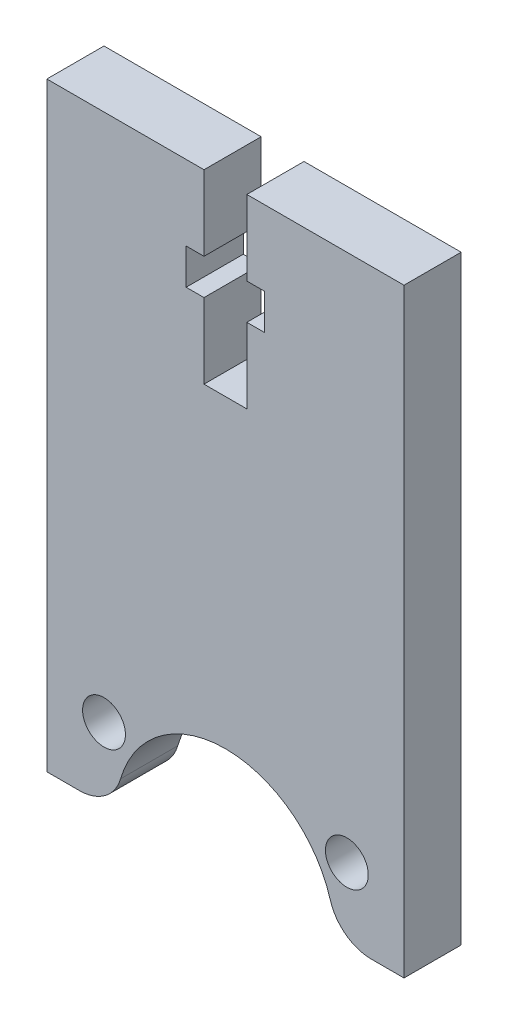
ISO-10303-21;
HEADER;
FILE_DESCRIPTION(('STEP AP214'),'2;1');
FILE_NAME('part.step','',(''),(''),'','','');
FILE_SCHEMA(('AUTOMOTIVE_DESIGN { 1 0 10303 214 1 1 1 1 }'));
ENDSEC;
DATA;
#1=APPLICATION_CONTEXT('core data for automotive mechanical design processes');
#2=APPLICATION_PROTOCOL_DEFINITION('international standard','automotive_design',2000,#1);
#3=PRODUCT_CONTEXT('',#1,'mechanical');
#4=PRODUCT('Part','Part','',(#3));
#5=PRODUCT_RELATED_PRODUCT_CATEGORY('part','',(#4));
#6=PRODUCT_DEFINITION_FORMATION('','',#4);
#7=PRODUCT_DEFINITION_CONTEXT('part definition',#1,'design');
#8=PRODUCT_DEFINITION('design','',#6,#7);
#9=PRODUCT_DEFINITION_SHAPE('','',#8);
#10=(LENGTH_UNIT() NAMED_UNIT(*) SI_UNIT(.MILLI.,.METRE.));
#11=(NAMED_UNIT(*) PLANE_ANGLE_UNIT() SI_UNIT($,.RADIAN.));
#12=(NAMED_UNIT(*) SI_UNIT($,.STERADIAN.) SOLID_ANGLE_UNIT());
#13=UNCERTAINTY_MEASURE_WITH_UNIT(LENGTH_MEASURE(1.E-05),#10,'distance_accuracy_value','');
#14=(GEOMETRIC_REPRESENTATION_CONTEXT(3) GLOBAL_UNCERTAINTY_ASSIGNED_CONTEXT((#13)) GLOBAL_UNIT_ASSIGNED_CONTEXT((#10,
#11,#12)) REPRESENTATION_CONTEXT('',''));
#15=CARTESIAN_POINT('',(0.,0.,0.));
#16=DIRECTION('',(0.,0.,1.));
#17=DIRECTION('',(1.,0.,0.));
#18=AXIS2_PLACEMENT_3D('',#15,#16,#17);
#19=CARTESIAN_POINT('',(22.7187327981507,3.,4.));
#20=DIRECTION('',(0.,0.,1.));
#21=DIRECTION('',(1.,0.,0.));
#22=AXIS2_PLACEMENT_3D('',#19,#20,#21);
#23=PLANE('',#22);
#24=CARTESIAN_POINT('',(4.,5.,4.));
#25=DIRECTION('',(0.,0.,1.));
#26=DIRECTION('',(1.,0.,0.));
#27=AXIS2_PLACEMENT_3D('',#24,#25,#26);
#28=CIRCLE('',#27,1.5);
#29=CARTESIAN_POINT('',(5.5,5.,4.));
#30=VERTEX_POINT('',#29);
#31=EDGE_CURVE('E218',#30,#30,#28,.T.);
#32=ORIENTED_EDGE('',*,*,#31,.F.);
#33=EDGE_LOOP('',(#32));
#34=FACE_BOUND('',#33,.T.);
#35=DIRECTION('',(0.,-1.,0.));
#36=VECTOR('',#35,1.);
#37=CARTESIAN_POINT('',(0.,0.,4.));
#38=LINE('',#37,#36);
#39=CARTESIAN_POINT('',(0.,42.,4.));
#40=VERTEX_POINT('',#39);
#41=CARTESIAN_POINT('',(0.,0.,4.));
#42=VERTEX_POINT('',#41);
#43=EDGE_CURVE('E272',#40,#42,#38,.T.);
#44=ORIENTED_EDGE('',*,*,#43,.T.);
#45=DIRECTION('',(1.,0.,0.));
#46=VECTOR('',#45,1.);
#47=CARTESIAN_POINT('',(0.,0.,4.));
#48=LINE('',#47,#46);
#49=CARTESIAN_POINT('',(2.28126720184934,0.,4.));
#50=VERTEX_POINT('',#49);
#51=EDGE_CURVE('E136',#42,#50,#48,.T.);
#52=ORIENTED_EDGE('',*,*,#51,.T.);
#53=CARTESIAN_POINT('',(2.28126720184934,3.,4.));
#54=DIRECTION('',(0.,0.,1.));
#55=DIRECTION('',(-1.,0.,0.));
#56=AXIS2_PLACEMENT_3D('',#53,#54,#55);
#57=CIRCLE('',#56,3.);
#58=CARTESIAN_POINT('',(5.15978348301854,2.15492957746479,4.));
#59=VERTEX_POINT('',#58);
#60=EDGE_CURVE('E341',#50,#59,#57,.T.);
#61=ORIENTED_EDGE('',*,*,#60,.T.);
#62=CARTESIAN_POINT('',(12.5,0.,4.));
#63=DIRECTION('',(0.,0.,-1.));
#64=DIRECTION('',(1.,0.,0.));
#65=AXIS2_PLACEMENT_3D('',#62,#63,#64);
#66=CIRCLE('',#65,7.65);
#67=CARTESIAN_POINT('',(19.8402165169815,2.15492957746479,4.));
#68=VERTEX_POINT('',#67);
#69=EDGE_CURVE('E361',#59,#68,#66,.T.);
#70=ORIENTED_EDGE('',*,*,#69,.T.);
#71=CARTESIAN_POINT('',(22.7187327981507,3.,4.));
#72=DIRECTION('',(0.,0.,1.));
#73=DIRECTION('',(1.,0.,0.));
#74=AXIS2_PLACEMENT_3D('',#71,#72,#73);
#75=CIRCLE('',#74,3.);
#76=CARTESIAN_POINT('',(22.7187327981507,0.,4.));
#77=VERTEX_POINT('',#76);
#78=EDGE_CURVE('E357',#68,#77,#75,.T.);
#79=ORIENTED_EDGE('',*,*,#78,.T.);
#80=DIRECTION('',(1.,0.,0.));
#81=VECTOR('',#80,1.);
#82=CARTESIAN_POINT('',(22.7187327981507,0.,4.));
#83=LINE('',#82,#81);
#84=CARTESIAN_POINT('',(25.,0.,4.));
#85=VERTEX_POINT('',#84);
#86=EDGE_CURVE('E360',#77,#85,#83,.T.);
#87=ORIENTED_EDGE('',*,*,#86,.T.);
#88=DIRECTION('',(0.,1.,0.));
#89=VECTOR('',#88,1.);
#90=CARTESIAN_POINT('',(25.,0.,4.));
#91=LINE('',#90,#89);
#92=CARTESIAN_POINT('',(25.,42.,4.));
#93=VERTEX_POINT('',#92);
#94=EDGE_CURVE('E365',#85,#93,#91,.T.);
#95=ORIENTED_EDGE('',*,*,#94,.T.);
#96=DIRECTION('',(-1.,0.,0.));
#97=VECTOR('',#96,1.);
#98=CARTESIAN_POINT('',(14.,42.,4.));
#99=LINE('',#98,#97);
#100=CARTESIAN_POINT('',(14.,42.,4.));
#101=VERTEX_POINT('',#100);
#102=EDGE_CURVE('E372',#93,#101,#99,.T.);
#103=ORIENTED_EDGE('',*,*,#102,.T.);
#104=DIRECTION('',(0.,-1.,0.));
#105=VECTOR('',#104,1.);
#106=CARTESIAN_POINT('',(14.,42.,4.));
#107=LINE('',#106,#105);
#108=CARTESIAN_POINT('',(14.,36.75,4.));
#109=VERTEX_POINT('',#108);
#110=EDGE_CURVE('E375',#101,#109,#107,.T.);
#111=ORIENTED_EDGE('',*,*,#110,.T.);
#112=DIRECTION('',(1.,0.,0.));
#113=VECTOR('',#112,1.);
#114=CARTESIAN_POINT('',(15.25,36.75,4.));
#115=LINE('',#114,#113);
#116=CARTESIAN_POINT('',(15.25,36.75,4.));
#117=VERTEX_POINT('',#116);
#118=EDGE_CURVE('E378',#109,#117,#115,.T.);
#119=ORIENTED_EDGE('',*,*,#118,.T.);
#120=DIRECTION('',(0.,-1.,0.));
#121=VECTOR('',#120,1.);
#122=CARTESIAN_POINT('',(15.25,34.25,4.));
#123=LINE('',#122,#121);
#124=CARTESIAN_POINT('',(15.25,34.25,4.));
#125=VERTEX_POINT('',#124);
#126=EDGE_CURVE('E381',#117,#125,#123,.T.);
#127=ORIENTED_EDGE('',*,*,#126,.T.);
#128=DIRECTION('',(-1.,0.,0.));
#129=VECTOR('',#128,1.);
#130=CARTESIAN_POINT('',(14.,34.25,4.));
#131=LINE('',#130,#129);
#132=CARTESIAN_POINT('',(14.,34.25,4.));
#133=VERTEX_POINT('',#132);
#134=EDGE_CURVE('E384',#125,#133,#131,.T.);
#135=ORIENTED_EDGE('',*,*,#134,.T.);
#136=DIRECTION('',(0.,-1.,0.));
#137=VECTOR('',#136,1.);
#138=CARTESIAN_POINT('',(14.,34.25,4.));
#139=LINE('',#138,#137);
#140=CARTESIAN_POINT('',(14.,29.,4.));
#141=VERTEX_POINT('',#140);
#142=EDGE_CURVE('E387',#133,#141,#139,.T.);
#143=ORIENTED_EDGE('',*,*,#142,.T.);
#144=DIRECTION('',(-1.,0.,0.));
#145=VECTOR('',#144,1.);
#146=CARTESIAN_POINT('',(11.,29.,4.));
#147=LINE('',#146,#145);
#148=CARTESIAN_POINT('',(11.,29.,4.));
#149=VERTEX_POINT('',#148);
#150=EDGE_CURVE('E390',#141,#149,#147,.T.);
#151=ORIENTED_EDGE('',*,*,#150,.T.);
#152=DIRECTION('',(0.,1.,0.));
#153=VECTOR('',#152,1.);
#154=CARTESIAN_POINT('',(11.,34.25,4.));
#155=LINE('',#154,#153);
#156=CARTESIAN_POINT('',(11.,34.25,4.));
#157=VERTEX_POINT('',#156);
#158=EDGE_CURVE('E393',#149,#157,#155,.T.);
#159=ORIENTED_EDGE('',*,*,#158,.T.);
#160=DIRECTION('',(-1.,0.,0.));
#161=VECTOR('',#160,1.);
#162=CARTESIAN_POINT('',(11.,34.25,4.));
#163=LINE('',#162,#161);
#164=CARTESIAN_POINT('',(9.75,34.25,4.));
#165=VERTEX_POINT('',#164);
#166=EDGE_CURVE('E396',#157,#165,#163,.T.);
#167=ORIENTED_EDGE('',*,*,#166,.T.);
#168=DIRECTION('',(0.,1.,0.));
#169=VECTOR('',#168,1.);
#170=CARTESIAN_POINT('',(9.75,34.25,4.));
#171=LINE('',#170,#169);
#172=CARTESIAN_POINT('',(9.75,36.75,4.));
#173=VERTEX_POINT('',#172);
#174=EDGE_CURVE('E191',#165,#173,#171,.T.);
#175=ORIENTED_EDGE('',*,*,#174,.T.);
#176=DIRECTION('',(1.,0.,0.));
#177=VECTOR('',#176,1.);
#178=CARTESIAN_POINT('',(9.75,36.75,4.));
#179=LINE('',#178,#177);
#180=CARTESIAN_POINT('',(11.,36.75,4.));
#181=VERTEX_POINT('',#180);
#182=EDGE_CURVE('E185',#173,#181,#179,.T.);
#183=ORIENTED_EDGE('',*,*,#182,.T.);
#184=DIRECTION('',(0.,1.,0.));
#185=VECTOR('',#184,1.);
#186=CARTESIAN_POINT('',(11.,42.,4.));
#187=LINE('',#186,#185);
#188=CARTESIAN_POINT('',(11.,42.,4.));
#189=VERTEX_POINT('',#188);
#190=EDGE_CURVE('E189',#181,#189,#187,.T.);
#191=ORIENTED_EDGE('',*,*,#190,.T.);
#192=DIRECTION('',(-1.,0.,0.));
#193=VECTOR('',#192,1.);
#194=CARTESIAN_POINT('',(0.,42.,4.));
#195=LINE('',#194,#193);
#196=EDGE_CURVE('E57',#189,#40,#195,.T.);
#197=ORIENTED_EDGE('',*,*,#196,.T.);
#198=EDGE_LOOP('',(#44,#52,#61,#70,#79,#87,#95,#103,#111,#119,#127,#135,#143,#151,#159,#167,
#175,#183,#191,#197));
#199=FACE_BOUND('',#198,.T.);
#200=CARTESIAN_POINT('',(21.,5.,4.));
#201=DIRECTION('',(0.,0.,1.));
#202=DIRECTION('',(-1.,0.,0.));
#203=AXIS2_PLACEMENT_3D('',#200,#201,#202);
#204=CIRCLE('',#203,1.5);
#205=CARTESIAN_POINT('',(19.5,5.,4.));
#206=VERTEX_POINT('',#205);
#207=EDGE_CURVE('E440',#206,#206,#204,.T.);
#208=ORIENTED_EDGE('',*,*,#207,.F.);
#209=EDGE_LOOP('',(#208));
#210=FACE_BOUND('',#209,.T.);
#211=ADVANCED_FACE('F39',(#34,#199,#210),#23,.T.);
#212=CARTESIAN_POINT('',(22.7187327981507,3.,0.));
#213=DIRECTION('',(0.,0.,1.));
#214=DIRECTION('',(1.,0.,0.));
#215=AXIS2_PLACEMENT_3D('',#212,#213,#214);
#216=PLANE('',#215);
#217=DIRECTION('',(0.,-1.,0.));
#218=VECTOR('',#217,1.);
#219=CARTESIAN_POINT('',(0.,0.,0.));
#220=LINE('',#219,#218);
#221=CARTESIAN_POINT('',(0.,42.,0.));
#222=VERTEX_POINT('',#221);
#223=CARTESIAN_POINT('',(0.,0.,0.));
#224=VERTEX_POINT('',#223);
#225=EDGE_CURVE('E213',#222,#224,#220,.T.);
#226=ORIENTED_EDGE('',*,*,#225,.F.);
#227=DIRECTION('',(-1.,0.,0.));
#228=VECTOR('',#227,1.);
#229=CARTESIAN_POINT('',(0.,42.,0.));
#230=LINE('',#229,#228);
#231=CARTESIAN_POINT('',(11.,42.,0.));
#232=VERTEX_POINT('',#231);
#233=EDGE_CURVE('E128',#232,#222,#230,.T.);
#234=ORIENTED_EDGE('',*,*,#233,.F.);
#235=DIRECTION('',(0.,1.,0.));
#236=VECTOR('',#235,1.);
#237=CARTESIAN_POINT('',(11.,42.,0.));
#238=LINE('',#237,#236);
#239=CARTESIAN_POINT('',(11.,36.75,0.));
#240=VERTEX_POINT('',#239);
#241=EDGE_CURVE('E122',#240,#232,#238,.T.);
#242=ORIENTED_EDGE('',*,*,#241,.F.);
#243=DIRECTION('',(1.,0.,0.));
#244=VECTOR('',#243,1.);
#245=CARTESIAN_POINT('',(9.75,36.75,0.));
#246=LINE('',#245,#244);
#247=CARTESIAN_POINT('',(9.75,36.75,0.));
#248=VERTEX_POINT('',#247);
#249=EDGE_CURVE('E200',#248,#240,#246,.T.);
#250=ORIENTED_EDGE('',*,*,#249,.F.);
#251=DIRECTION('',(0.,1.,0.));
#252=VECTOR('',#251,1.);
#253=CARTESIAN_POINT('',(9.75,34.25,0.));
#254=LINE('',#253,#252);
#255=CARTESIAN_POINT('',(9.75,34.25,0.));
#256=VERTEX_POINT('',#255);
#257=EDGE_CURVE('E263',#256,#248,#254,.T.);
#258=ORIENTED_EDGE('',*,*,#257,.F.);
#259=DIRECTION('',(-1.,0.,0.));
#260=VECTOR('',#259,1.);
#261=CARTESIAN_POINT('',(11.,34.25,0.));
#262=LINE('',#261,#260);
#263=CARTESIAN_POINT('',(11.,34.25,0.));
#264=VERTEX_POINT('',#263);
#265=EDGE_CURVE('E260',#264,#256,#262,.T.);
#266=ORIENTED_EDGE('',*,*,#265,.F.);
#267=DIRECTION('',(0.,1.,0.));
#268=VECTOR('',#267,1.);
#269=CARTESIAN_POINT('',(11.,34.25,0.));
#270=LINE('',#269,#268);
#271=CARTESIAN_POINT('',(11.,29.,0.));
#272=VERTEX_POINT('',#271);
#273=EDGE_CURVE('E257',#272,#264,#270,.T.);
#274=ORIENTED_EDGE('',*,*,#273,.F.);
#275=DIRECTION('',(-1.,0.,0.));
#276=VECTOR('',#275,1.);
#277=CARTESIAN_POINT('',(11.,29.,0.));
#278=LINE('',#277,#276);
#279=CARTESIAN_POINT('',(14.,29.,0.));
#280=VERTEX_POINT('',#279);
#281=EDGE_CURVE('E254',#280,#272,#278,.T.);
#282=ORIENTED_EDGE('',*,*,#281,.F.);
#283=DIRECTION('',(0.,-1.,0.));
#284=VECTOR('',#283,1.);
#285=CARTESIAN_POINT('',(14.,34.25,0.));
#286=LINE('',#285,#284);
#287=CARTESIAN_POINT('',(14.,34.25,0.));
#288=VERTEX_POINT('',#287);
#289=EDGE_CURVE('E251',#288,#280,#286,.T.);
#290=ORIENTED_EDGE('',*,*,#289,.F.);
#291=DIRECTION('',(-1.,0.,0.));
#292=VECTOR('',#291,1.);
#293=CARTESIAN_POINT('',(14.,34.25,0.));
#294=LINE('',#293,#292);
#295=CARTESIAN_POINT('',(15.25,34.25,0.));
#296=VERTEX_POINT('',#295);
#297=EDGE_CURVE('E248',#296,#288,#294,.T.);
#298=ORIENTED_EDGE('',*,*,#297,.F.);
#299=DIRECTION('',(0.,-1.,0.));
#300=VECTOR('',#299,1.);
#301=CARTESIAN_POINT('',(15.25,34.25,0.));
#302=LINE('',#301,#300);
#303=CARTESIAN_POINT('',(15.25,36.75,0.));
#304=VERTEX_POINT('',#303);
#305=EDGE_CURVE('E245',#304,#296,#302,.T.);
#306=ORIENTED_EDGE('',*,*,#305,.F.);
#307=DIRECTION('',(1.,0.,0.));
#308=VECTOR('',#307,1.);
#309=CARTESIAN_POINT('',(15.25,36.75,0.));
#310=LINE('',#309,#308);
#311=CARTESIAN_POINT('',(14.,36.75,0.));
#312=VERTEX_POINT('',#311);
#313=EDGE_CURVE('E242',#312,#304,#310,.T.);
#314=ORIENTED_EDGE('',*,*,#313,.F.);
#315=DIRECTION('',(0.,-1.,0.));
#316=VECTOR('',#315,1.);
#317=CARTESIAN_POINT('',(14.,42.,0.));
#318=LINE('',#317,#316);
#319=CARTESIAN_POINT('',(14.,42.,0.));
#320=VERTEX_POINT('',#319);
#321=EDGE_CURVE('E239',#320,#312,#318,.T.);
#322=ORIENTED_EDGE('',*,*,#321,.F.);
#323=DIRECTION('',(-1.,0.,0.));
#324=VECTOR('',#323,1.);
#325=CARTESIAN_POINT('',(14.,42.,0.));
#326=LINE('',#325,#324);
#327=CARTESIAN_POINT('',(25.,42.,0.));
#328=VERTEX_POINT('',#327);
#329=EDGE_CURVE('E236',#328,#320,#326,.T.);
#330=ORIENTED_EDGE('',*,*,#329,.F.);
#331=DIRECTION('',(0.,1.,0.));
#332=VECTOR('',#331,1.);
#333=CARTESIAN_POINT('',(25.,0.,0.));
#334=LINE('',#333,#332);
#335=CARTESIAN_POINT('',(25.,0.,0.));
#336=VERTEX_POINT('',#335);
#337=EDGE_CURVE('E233',#336,#328,#334,.T.);
#338=ORIENTED_EDGE('',*,*,#337,.F.);
#339=DIRECTION('',(1.,0.,0.));
#340=VECTOR('',#339,1.);
#341=CARTESIAN_POINT('',(22.7187327981507,0.,0.));
#342=LINE('',#341,#340);
#343=CARTESIAN_POINT('',(22.7187327981507,0.,0.));
#344=VERTEX_POINT('',#343);
#345=EDGE_CURVE('E230',#344,#336,#342,.T.);
#346=ORIENTED_EDGE('',*,*,#345,.F.);
#347=CARTESIAN_POINT('',(22.7187327981507,3.,0.));
#348=DIRECTION('',(0.,0.,1.));
#349=DIRECTION('',(1.,0.,0.));
#350=AXIS2_PLACEMENT_3D('',#347,#348,#349);
#351=CIRCLE('',#350,3.);
#352=CARTESIAN_POINT('',(19.8402165169815,2.15492957746479,0.));
#353=VERTEX_POINT('',#352);
#354=EDGE_CURVE('E227',#353,#344,#351,.T.);
#355=ORIENTED_EDGE('',*,*,#354,.F.);
#356=CARTESIAN_POINT('',(12.5,0.,0.));
#357=DIRECTION('',(0.,0.,-1.));
#358=DIRECTION('',(1.,0.,0.));
#359=AXIS2_PLACEMENT_3D('',#356,#357,#358);
#360=CIRCLE('',#359,7.65);
#361=CARTESIAN_POINT('',(5.15978348301854,2.15492957746479,0.));
#362=VERTEX_POINT('',#361);
#363=EDGE_CURVE('E224',#362,#353,#360,.T.);
#364=ORIENTED_EDGE('',*,*,#363,.F.);
#365=CARTESIAN_POINT('',(2.28126720184934,3.,0.));
#366=DIRECTION('',(0.,0.,1.));
#367=DIRECTION('',(-1.,0.,0.));
#368=AXIS2_PLACEMENT_3D('',#365,#366,#367);
#369=CIRCLE('',#368,3.);
#370=CARTESIAN_POINT('',(2.28126720184934,0.,0.));
#371=VERTEX_POINT('',#370);
#372=EDGE_CURVE('E221',#371,#362,#369,.T.);
#373=ORIENTED_EDGE('',*,*,#372,.F.);
#374=DIRECTION('',(1.,0.,0.));
#375=VECTOR('',#374,1.);
#376=CARTESIAN_POINT('',(0.,0.,0.));
#377=LINE('',#376,#375);
#378=EDGE_CURVE('E217',#224,#371,#377,.T.);
#379=ORIENTED_EDGE('',*,*,#378,.F.);
#380=EDGE_LOOP('',(#226,#234,#242,#250,#258,#266,#274,#282,#290,#298,#306,#314,#322,#330,#338,
#346,#355,#364,#373,#379));
#381=FACE_BOUND('',#380,.T.);
#382=CARTESIAN_POINT('',(4.,5.,0.));
#383=DIRECTION('',(0.,0.,1.));
#384=DIRECTION('',(1.,0.,0.));
#385=AXIS2_PLACEMENT_3D('',#382,#383,#384);
#386=CIRCLE('',#385,1.5);
#387=CARTESIAN_POINT('',(5.5,5.,0.));
#388=VERTEX_POINT('',#387);
#389=EDGE_CURVE('E448',#388,#388,#386,.T.);
#390=ORIENTED_EDGE('',*,*,#389,.T.);
#391=EDGE_LOOP('',(#390));
#392=FACE_BOUND('',#391,.T.);
#393=CARTESIAN_POINT('',(21.,5.,0.));
#394=DIRECTION('',(0.,0.,1.));
#395=DIRECTION('',(-1.,0.,0.));
#396=AXIS2_PLACEMENT_3D('',#393,#394,#395);
#397=CIRCLE('',#396,1.5);
#398=CARTESIAN_POINT('',(19.5,5.,0.));
#399=VERTEX_POINT('',#398);
#400=EDGE_CURVE('E443',#399,#399,#397,.T.);
#401=ORIENTED_EDGE('',*,*,#400,.T.);
#402=EDGE_LOOP('',(#401));
#403=FACE_BOUND('',#402,.T.);
#404=ADVANCED_FACE('F345',(#381,#392,#403),#216,.F.);
#405=CARTESIAN_POINT('',(0.,0.,4.));
#406=DIRECTION('',(1.,0.,0.));
#407=DIRECTION('',(0.,0.,-1.));
#408=AXIS2_PLACEMENT_3D('',#405,#406,#407);
#409=PLANE('',#408);
#410=ORIENTED_EDGE('',*,*,#225,.T.);
#411=DIRECTION('',(0.,0.,-1.));
#412=VECTOR('',#411,1.);
#413=CARTESIAN_POINT('',(0.,0.,4.));
#414=LINE('',#413,#412);
#415=EDGE_CURVE('E11',#42,#224,#414,.T.);
#416=ORIENTED_EDGE('',*,*,#415,.F.);
#417=ORIENTED_EDGE('',*,*,#43,.F.);
#418=DIRECTION('',(0.,0.,-1.));
#419=VECTOR('',#418,1.);
#420=CARTESIAN_POINT('',(0.,42.,4.));
#421=LINE('',#420,#419);
#422=EDGE_CURVE('E209',#40,#222,#421,.T.);
#423=ORIENTED_EDGE('',*,*,#422,.T.);
#424=EDGE_LOOP('',(#410,#416,#417,#423));
#425=FACE_BOUND('',#424,.T.);
#426=ADVANCED_FACE('F41',(#425),#409,.F.);
#427=CARTESIAN_POINT('',(0.,0.,4.));
#428=DIRECTION('',(0.,1.,0.));
#429=DIRECTION('',(0.,0.,1.));
#430=AXIS2_PLACEMENT_3D('',#427,#428,#429);
#431=PLANE('',#430);
#432=ORIENTED_EDGE('',*,*,#378,.T.);
#433=DIRECTION('',(0.,0.,-1.));
#434=VECTOR('',#433,1.);
#435=CARTESIAN_POINT('',(2.28126720184934,0.,4.));
#436=LINE('',#435,#434);
#437=EDGE_CURVE('E49',#50,#371,#436,.T.);
#438=ORIENTED_EDGE('',*,*,#437,.F.);
#439=ORIENTED_EDGE('',*,*,#51,.F.);
#440=ORIENTED_EDGE('',*,*,#415,.T.);
#441=EDGE_LOOP('',(#432,#438,#439,#440));
#442=FACE_BOUND('',#441,.T.);
#443=ADVANCED_FACE('F626',(#442),#431,.F.);
#444=CARTESIAN_POINT('',(2.28126720184934,3.,4.));
#445=DIRECTION('',(0.,0.,-1.));
#446=DIRECTION('',(-1.,0.,0.));
#447=AXIS2_PLACEMENT_3D('',#444,#445,#446);
#448=CYLINDRICAL_SURFACE('',#447,3.);
#449=ORIENTED_EDGE('',*,*,#372,.T.);
#450=DIRECTION('',(0.,0.,-1.));
#451=VECTOR('',#450,1.);
#452=CARTESIAN_POINT('',(5.15978348301854,2.15492957746479,4.));
#453=LINE('',#452,#451);
#454=EDGE_CURVE('E331',#59,#362,#453,.T.);
#455=ORIENTED_EDGE('',*,*,#454,.F.);
#456=ORIENTED_EDGE('',*,*,#60,.F.);
#457=ORIENTED_EDGE('',*,*,#437,.T.);
#458=EDGE_LOOP('',(#449,#455,#456,#457));
#459=FACE_BOUND('',#458,.T.);
#460=ADVANCED_FACE('F339',(#459),#448,.T.);
#461=CARTESIAN_POINT('',(12.5,0.,4.));
#462=DIRECTION('',(0.,0.,-1.));
#463=DIRECTION('',(-1.,0.,0.));
#464=AXIS2_PLACEMENT_3D('',#461,#462,#463);
#465=CYLINDRICAL_SURFACE('',#464,7.65);
#466=ORIENTED_EDGE('',*,*,#363,.T.);
#467=DIRECTION('',(0.,0.,-1.));
#468=VECTOR('',#467,1.);
#469=CARTESIAN_POINT('',(19.8402165169815,2.15492957746479,4.));
#470=LINE('',#469,#468);
#471=EDGE_CURVE('E327',#68,#353,#470,.T.);
#472=ORIENTED_EDGE('',*,*,#471,.F.);
#473=ORIENTED_EDGE('',*,*,#69,.F.);
#474=ORIENTED_EDGE('',*,*,#454,.T.);
#475=EDGE_LOOP('',(#466,#472,#473,#474));
#476=FACE_BOUND('',#475,.T.);
#477=ADVANCED_FACE('F351',(#476),#465,.F.);
#478=CARTESIAN_POINT('',(22.7187327981507,3.,4.));
#479=DIRECTION('',(0.,0.,-1.));
#480=DIRECTION('',(-1.,0.,0.));
#481=AXIS2_PLACEMENT_3D('',#478,#479,#480);
#482=CYLINDRICAL_SURFACE('',#481,3.);
#483=ORIENTED_EDGE('',*,*,#354,.T.);
#484=DIRECTION('',(0.,0.,-1.));
#485=VECTOR('',#484,1.);
#486=CARTESIAN_POINT('',(22.7187327981507,0.,4.));
#487=LINE('',#486,#485);
#488=EDGE_CURVE('E323',#77,#344,#487,.T.);
#489=ORIENTED_EDGE('',*,*,#488,.F.);
#490=ORIENTED_EDGE('',*,*,#78,.F.);
#491=ORIENTED_EDGE('',*,*,#471,.T.);
#492=EDGE_LOOP('',(#483,#489,#490,#491));
#493=FACE_BOUND('',#492,.T.);
#494=ADVANCED_FACE('F355',(#493),#482,.T.);
#495=CARTESIAN_POINT('',(22.7187327981507,0.,4.));
#496=DIRECTION('',(0.,1.,0.));
#497=DIRECTION('',(0.,0.,1.));
#498=AXIS2_PLACEMENT_3D('',#495,#496,#497);
#499=PLANE('',#498);
#500=ORIENTED_EDGE('',*,*,#345,.T.);
#501=DIRECTION('',(0.,0.,-1.));
#502=VECTOR('',#501,1.);
#503=CARTESIAN_POINT('',(25.,0.,4.));
#504=LINE('',#503,#502);
#505=EDGE_CURVE('E319',#85,#336,#504,.T.);
#506=ORIENTED_EDGE('',*,*,#505,.F.);
#507=ORIENTED_EDGE('',*,*,#86,.F.);
#508=ORIENTED_EDGE('',*,*,#488,.T.);
#509=EDGE_LOOP('',(#500,#506,#507,#508));
#510=FACE_BOUND('',#509,.T.);
#511=ADVANCED_FACE('F591',(#510),#499,.F.);
#512=CARTESIAN_POINT('',(25.,0.,4.));
#513=DIRECTION('',(-1.,0.,0.));
#514=DIRECTION('',(0.,0.,1.));
#515=AXIS2_PLACEMENT_3D('',#512,#513,#514);
#516=PLANE('',#515);
#517=ORIENTED_EDGE('',*,*,#337,.T.);
#518=DIRECTION('',(0.,0.,-1.));
#519=VECTOR('',#518,1.);
#520=CARTESIAN_POINT('',(25.,42.,4.));
#521=LINE('',#520,#519);
#522=EDGE_CURVE('E315',#93,#328,#521,.T.);
#523=ORIENTED_EDGE('',*,*,#522,.F.);
#524=ORIENTED_EDGE('',*,*,#94,.F.);
#525=ORIENTED_EDGE('',*,*,#505,.T.);
#526=EDGE_LOOP('',(#517,#523,#524,#525));
#527=FACE_BOUND('',#526,.T.);
#528=ADVANCED_FACE('F581',(#527),#516,.F.);
#529=CARTESIAN_POINT('',(14.,42.,4.));
#530=DIRECTION('',(0.,-1.,0.));
#531=DIRECTION('',(0.,0.,-1.));
#532=AXIS2_PLACEMENT_3D('',#529,#530,#531);
#533=PLANE('',#532);
#534=ORIENTED_EDGE('',*,*,#329,.T.);
#535=DIRECTION('',(0.,0.,-1.));
#536=VECTOR('',#535,1.);
#537=CARTESIAN_POINT('',(14.,42.,4.));
#538=LINE('',#537,#536);
#539=EDGE_CURVE('E311',#101,#320,#538,.T.);
#540=ORIENTED_EDGE('',*,*,#539,.F.);
#541=ORIENTED_EDGE('',*,*,#102,.F.);
#542=ORIENTED_EDGE('',*,*,#522,.T.);
#543=EDGE_LOOP('',(#534,#540,#541,#542));
#544=FACE_BOUND('',#543,.T.);
#545=ADVANCED_FACE('F571',(#544),#533,.F.);
#546=CARTESIAN_POINT('',(14.,42.,4.));
#547=DIRECTION('',(1.,0.,0.));
#548=DIRECTION('',(0.,0.,-1.));
#549=AXIS2_PLACEMENT_3D('',#546,#547,#548);
#550=PLANE('',#549);
#551=ORIENTED_EDGE('',*,*,#321,.T.);
#552=DIRECTION('',(0.,0.,-1.));
#553=VECTOR('',#552,1.);
#554=CARTESIAN_POINT('',(14.,36.75,4.));
#555=LINE('',#554,#553);
#556=EDGE_CURVE('E307',#109,#312,#555,.T.);
#557=ORIENTED_EDGE('',*,*,#556,.F.);
#558=ORIENTED_EDGE('',*,*,#110,.F.);
#559=ORIENTED_EDGE('',*,*,#539,.T.);
#560=EDGE_LOOP('',(#551,#557,#558,#559));
#561=FACE_BOUND('',#560,.T.);
#562=ADVANCED_FACE('F561',(#561),#550,.F.);
#563=CARTESIAN_POINT('',(15.25,36.75,4.));
#564=DIRECTION('',(0.,1.,0.));
#565=DIRECTION('',(0.,0.,1.));
#566=AXIS2_PLACEMENT_3D('',#563,#564,#565);
#567=PLANE('',#566);
#568=ORIENTED_EDGE('',*,*,#313,.T.);
#569=DIRECTION('',(0.,0.,-1.));
#570=VECTOR('',#569,1.);
#571=CARTESIAN_POINT('',(15.25,36.75,4.));
#572=LINE('',#571,#570);
#573=EDGE_CURVE('E303',#117,#304,#572,.T.);
#574=ORIENTED_EDGE('',*,*,#573,.F.);
#575=ORIENTED_EDGE('',*,*,#118,.F.);
#576=ORIENTED_EDGE('',*,*,#556,.T.);
#577=EDGE_LOOP('',(#568,#574,#575,#576));
#578=FACE_BOUND('',#577,.T.);
#579=ADVANCED_FACE('F551',(#578),#567,.F.);
#580=CARTESIAN_POINT('',(15.25,34.25,4.));
#581=DIRECTION('',(1.,0.,0.));
#582=DIRECTION('',(0.,0.,-1.));
#583=AXIS2_PLACEMENT_3D('',#580,#581,#582);
#584=PLANE('',#583);
#585=ORIENTED_EDGE('',*,*,#305,.T.);
#586=DIRECTION('',(0.,0.,-1.));
#587=VECTOR('',#586,1.);
#588=CARTESIAN_POINT('',(15.25,34.25,4.));
#589=LINE('',#588,#587);
#590=EDGE_CURVE('E299',#125,#296,#589,.T.);
#591=ORIENTED_EDGE('',*,*,#590,.F.);
#592=ORIENTED_EDGE('',*,*,#126,.F.);
#593=ORIENTED_EDGE('',*,*,#573,.T.);
#594=EDGE_LOOP('',(#585,#591,#592,#593));
#595=FACE_BOUND('',#594,.T.);
#596=ADVANCED_FACE('F541',(#595),#584,.F.);
#597=CARTESIAN_POINT('',(14.,34.25,4.));
#598=DIRECTION('',(0.,-1.,0.));
#599=DIRECTION('',(0.,0.,-1.));
#600=AXIS2_PLACEMENT_3D('',#597,#598,#599);
#601=PLANE('',#600);
#602=ORIENTED_EDGE('',*,*,#297,.T.);
#603=DIRECTION('',(0.,0.,-1.));
#604=VECTOR('',#603,1.);
#605=CARTESIAN_POINT('',(14.,34.25,4.));
#606=LINE('',#605,#604);
#607=EDGE_CURVE('E295',#133,#288,#606,.T.);
#608=ORIENTED_EDGE('',*,*,#607,.F.);
#609=ORIENTED_EDGE('',*,*,#134,.F.);
#610=ORIENTED_EDGE('',*,*,#590,.T.);
#611=EDGE_LOOP('',(#602,#608,#609,#610));
#612=FACE_BOUND('',#611,.T.);
#613=ADVANCED_FACE('F531',(#612),#601,.F.);
#614=CARTESIAN_POINT('',(14.,34.25,4.));
#615=DIRECTION('',(1.,0.,0.));
#616=DIRECTION('',(0.,0.,-1.));
#617=AXIS2_PLACEMENT_3D('',#614,#615,#616);
#618=PLANE('',#617);
#619=ORIENTED_EDGE('',*,*,#289,.T.);
#620=DIRECTION('',(0.,0.,-1.));
#621=VECTOR('',#620,1.);
#622=CARTESIAN_POINT('',(14.,29.,4.));
#623=LINE('',#622,#621);
#624=EDGE_CURVE('E291',#141,#280,#623,.T.);
#625=ORIENTED_EDGE('',*,*,#624,.F.);
#626=ORIENTED_EDGE('',*,*,#142,.F.);
#627=ORIENTED_EDGE('',*,*,#607,.T.);
#628=EDGE_LOOP('',(#619,#625,#626,#627));
#629=FACE_BOUND('',#628,.T.);
#630=ADVANCED_FACE('F521',(#629),#618,.F.);
#631=CARTESIAN_POINT('',(11.,29.,4.));
#632=DIRECTION('',(0.,-1.,0.));
#633=DIRECTION('',(0.,0.,-1.));
#634=AXIS2_PLACEMENT_3D('',#631,#632,#633);
#635=PLANE('',#634);
#636=ORIENTED_EDGE('',*,*,#281,.T.);
#637=DIRECTION('',(0.,0.,-1.));
#638=VECTOR('',#637,1.);
#639=CARTESIAN_POINT('',(11.,29.,4.));
#640=LINE('',#639,#638);
#641=EDGE_CURVE('E287',#149,#272,#640,.T.);
#642=ORIENTED_EDGE('',*,*,#641,.F.);
#643=ORIENTED_EDGE('',*,*,#150,.F.);
#644=ORIENTED_EDGE('',*,*,#624,.T.);
#645=EDGE_LOOP('',(#636,#642,#643,#644));
#646=FACE_BOUND('',#645,.T.);
#647=ADVANCED_FACE('F511',(#646),#635,.F.);
#648=CARTESIAN_POINT('',(11.,34.25,4.));
#649=DIRECTION('',(-1.,0.,0.));
#650=DIRECTION('',(0.,-1.,0.));
#651=AXIS2_PLACEMENT_3D('',#648,#649,#650);
#652=PLANE('',#651);
#653=ORIENTED_EDGE('',*,*,#273,.T.);
#654=DIRECTION('',(0.,0.,-1.));
#655=VECTOR('',#654,1.);
#656=CARTESIAN_POINT('',(11.,34.25,4.));
#657=LINE('',#656,#655);
#658=EDGE_CURVE('E283',#157,#264,#657,.T.);
#659=ORIENTED_EDGE('',*,*,#658,.F.);
#660=ORIENTED_EDGE('',*,*,#158,.F.);
#661=ORIENTED_EDGE('',*,*,#641,.T.);
#662=EDGE_LOOP('',(#653,#659,#660,#661));
#663=FACE_BOUND('',#662,.T.);
#664=ADVANCED_FACE('F502',(#663),#652,.F.);
#665=CARTESIAN_POINT('',(11.,34.25,4.));
#666=DIRECTION('',(0.,-1.,0.));
#667=DIRECTION('',(0.,0.,-1.));
#668=AXIS2_PLACEMENT_3D('',#665,#666,#667);
#669=PLANE('',#668);
#670=ORIENTED_EDGE('',*,*,#265,.T.);
#671=DIRECTION('',(0.,0.,-1.));
#672=VECTOR('',#671,1.);
#673=CARTESIAN_POINT('',(9.75,34.25,4.));
#674=LINE('',#673,#672);
#675=EDGE_CURVE('E279',#165,#256,#674,.T.);
#676=ORIENTED_EDGE('',*,*,#675,.F.);
#677=ORIENTED_EDGE('',*,*,#166,.F.);
#678=ORIENTED_EDGE('',*,*,#658,.T.);
#679=EDGE_LOOP('',(#670,#676,#677,#678));
#680=FACE_BOUND('',#679,.T.);
#681=ADVANCED_FACE('F404',(#680),#669,.F.);
#682=CARTESIAN_POINT('',(9.75,34.25,4.));
#683=DIRECTION('',(-1.,0.,0.));
#684=DIRECTION('',(0.,0.,1.));
#685=AXIS2_PLACEMENT_3D('',#682,#683,#684);
#686=PLANE('',#685);
#687=ORIENTED_EDGE('',*,*,#257,.T.);
#688=DIRECTION('',(0.,0.,-1.));
#689=VECTOR('',#688,1.);
#690=CARTESIAN_POINT('',(9.75,36.75,4.));
#691=LINE('',#690,#689);
#692=EDGE_CURVE('E202',#173,#248,#691,.T.);
#693=ORIENTED_EDGE('',*,*,#692,.F.);
#694=ORIENTED_EDGE('',*,*,#174,.F.);
#695=ORIENTED_EDGE('',*,*,#675,.T.);
#696=EDGE_LOOP('',(#687,#693,#694,#695));
#697=FACE_BOUND('',#696,.T.);
#698=ADVANCED_FACE('F408',(#697),#686,.F.);
#699=CARTESIAN_POINT('',(9.75,36.75,4.));
#700=DIRECTION('',(0.,1.,0.));
#701=DIRECTION('',(0.,0.,1.));
#702=AXIS2_PLACEMENT_3D('',#699,#700,#701);
#703=PLANE('',#702);
#704=ORIENTED_EDGE('',*,*,#249,.T.);
#705=DIRECTION('',(0.,0.,-1.));
#706=VECTOR('',#705,1.);
#707=CARTESIAN_POINT('',(11.,36.75,4.));
#708=LINE('',#707,#706);
#709=EDGE_CURVE('E197',#181,#240,#708,.T.);
#710=ORIENTED_EDGE('',*,*,#709,.F.);
#711=ORIENTED_EDGE('',*,*,#182,.F.);
#712=ORIENTED_EDGE('',*,*,#692,.T.);
#713=EDGE_LOOP('',(#704,#710,#711,#712));
#714=FACE_BOUND('',#713,.T.);
#715=ADVANCED_FACE('F198',(#714),#703,.F.);
#716=CARTESIAN_POINT('',(11.,42.,4.));
#717=DIRECTION('',(-1.,0.,0.));
#718=DIRECTION('',(0.,0.,1.));
#719=AXIS2_PLACEMENT_3D('',#716,#717,#718);
#720=PLANE('',#719);
#721=ORIENTED_EDGE('',*,*,#241,.T.);
#722=DIRECTION('',(0.,0.,-1.));
#723=VECTOR('',#722,1.);
#724=CARTESIAN_POINT('',(11.,42.,4.));
#725=LINE('',#724,#723);
#726=EDGE_CURVE('E203',#189,#232,#725,.T.);
#727=ORIENTED_EDGE('',*,*,#726,.F.);
#728=ORIENTED_EDGE('',*,*,#190,.F.);
#729=ORIENTED_EDGE('',*,*,#709,.T.);
#730=EDGE_LOOP('',(#721,#727,#728,#729));
#731=FACE_BOUND('',#730,.T.);
#732=ADVANCED_FACE('F205',(#731),#720,.F.);
#733=CARTESIAN_POINT('',(0.,42.,4.));
#734=DIRECTION('',(0.,-1.,0.));
#735=DIRECTION('',(0.,0.,-1.));
#736=AXIS2_PLACEMENT_3D('',#733,#734,#735);
#737=PLANE('',#736);
#738=ORIENTED_EDGE('',*,*,#233,.T.);
#739=ORIENTED_EDGE('',*,*,#422,.F.);
#740=ORIENTED_EDGE('',*,*,#196,.F.);
#741=ORIENTED_EDGE('',*,*,#726,.T.);
#742=EDGE_LOOP('',(#738,#739,#740,#741));
#743=FACE_BOUND('',#742,.T.);
#744=ADVANCED_FACE('F412',(#743),#737,.F.);
#745=CARTESIAN_POINT('',(4.,5.,4.));
#746=DIRECTION('',(0.,0.,-1.));
#747=DIRECTION('',(-1.,0.,0.));
#748=AXIS2_PLACEMENT_3D('',#745,#746,#747);
#749=CYLINDRICAL_SURFACE('',#748,1.5);
#750=ORIENTED_EDGE('',*,*,#31,.T.);
#751=EDGE_LOOP('',(#750));
#752=FACE_BOUND('',#751,.T.);
#753=ORIENTED_EDGE('',*,*,#389,.F.);
#754=EDGE_LOOP('',(#753));
#755=FACE_BOUND('',#754,.T.);
#756=ADVANCED_FACE('F414',(#752,#755),#749,.F.);
#757=CARTESIAN_POINT('',(21.,5.,4.));
#758=DIRECTION('',(0.,0.,-1.));
#759=DIRECTION('',(-1.,0.,0.));
#760=AXIS2_PLACEMENT_3D('',#757,#758,#759);
#761=CYLINDRICAL_SURFACE('',#760,1.5);
#762=ORIENTED_EDGE('',*,*,#207,.T.);
#763=EDGE_LOOP('',(#762));
#764=FACE_BOUND('',#763,.T.);
#765=ORIENTED_EDGE('',*,*,#400,.F.);
#766=EDGE_LOOP('',(#765));
#767=FACE_BOUND('',#766,.T.);
#768=ADVANCED_FACE('F420',(#764,#767),#761,.F.);
#769=CLOSED_SHELL('',(#211,#404,#426,#443,#460,#477,#494,#511,#528,#545,#562,#579,#596,#613,
#630,#647,#664,#681,#698,#715,#732,#744,#756,#768));
#770=MANIFOLD_SOLID_BREP('B2',#769);
#771=ADVANCED_BREP_SHAPE_REPRESENTATION('',(#18,#770),#14);
#772=SHAPE_DEFINITION_REPRESENTATION(#9,#771);
ENDSEC;
END-ISO-10303-21;
